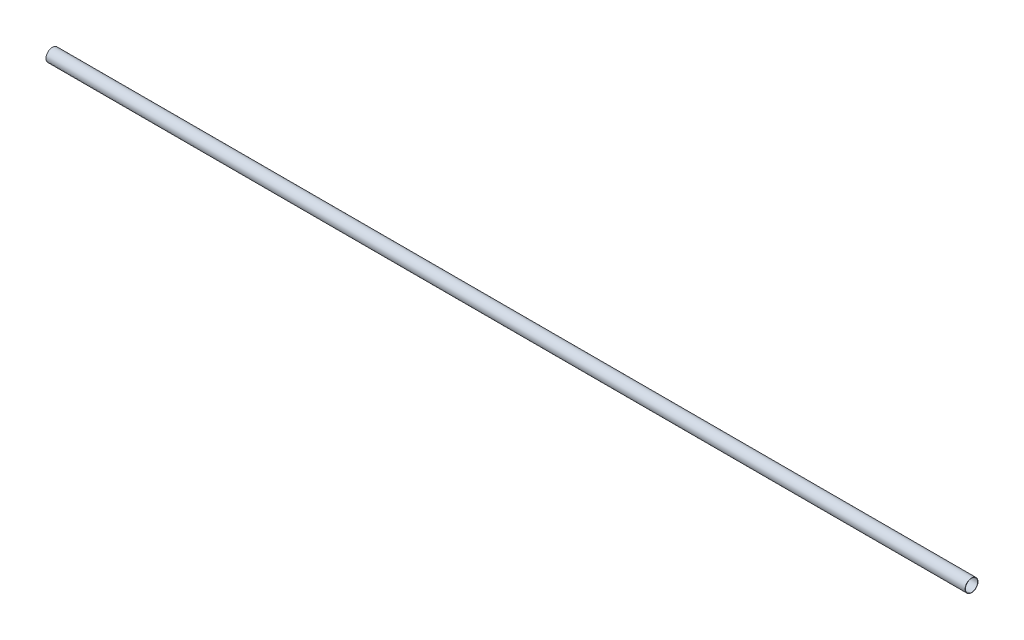
ISO-10303-21;
HEADER;
FILE_DESCRIPTION(('STEP AP214'),'2;1');
FILE_NAME('part.step','',(''),(''),'','','');
FILE_SCHEMA(('AUTOMOTIVE_DESIGN { 1 0 10303 214 1 1 1 1 }'));
ENDSEC;
DATA;
#1=APPLICATION_CONTEXT('core data for automotive mechanical design processes');
#2=APPLICATION_PROTOCOL_DEFINITION('international standard','automotive_design',2000,#1);
#3=PRODUCT_CONTEXT('',#1,'mechanical');
#4=PRODUCT('Part','Part','',(#3));
#5=PRODUCT_RELATED_PRODUCT_CATEGORY('part','',(#4));
#6=PRODUCT_DEFINITION_FORMATION('','',#4);
#7=PRODUCT_DEFINITION_CONTEXT('part definition',#1,'design');
#8=PRODUCT_DEFINITION('design','',#6,#7);
#9=PRODUCT_DEFINITION_SHAPE('','',#8);
#10=(LENGTH_UNIT() NAMED_UNIT(*) SI_UNIT(.MILLI.,.METRE.));
#11=(NAMED_UNIT(*) PLANE_ANGLE_UNIT() SI_UNIT($,.RADIAN.));
#12=(NAMED_UNIT(*) SI_UNIT($,.STERADIAN.) SOLID_ANGLE_UNIT());
#13=UNCERTAINTY_MEASURE_WITH_UNIT(LENGTH_MEASURE(1.E-05),#10,'distance_accuracy_value','');
#14=(GEOMETRIC_REPRESENTATION_CONTEXT(3) GLOBAL_UNCERTAINTY_ASSIGNED_CONTEXT((#13)) GLOBAL_UNIT_ASSIGNED_CONTEXT((#10,
#11,#12)) REPRESENTATION_CONTEXT('',''));
#15=CARTESIAN_POINT('',(0.,0.,0.));
#16=DIRECTION('',(0.,0.,1.));
#17=DIRECTION('',(1.,0.,0.));
#18=AXIS2_PLACEMENT_3D('',#15,#16,#17);
#19=CARTESIAN_POINT('',(300.,0.,0.));
#20=DIRECTION('',(1.,0.,0.));
#21=DIRECTION('',(0.,0.,-1.));
#22=AXIS2_PLACEMENT_3D('',#19,#20,#21);
#23=PLANE('',#22);
#24=CARTESIAN_POINT('',(300.,0.,0.));
#25=DIRECTION('',(1.,0.,0.));
#26=DIRECTION('',(0.,0.,-1.));
#27=AXIS2_PLACEMENT_3D('',#24,#25,#26);
#28=CIRCLE('',#27,2.1);
#29=CARTESIAN_POINT('',(300.,0.,-2.1));
#30=VERTEX_POINT('',#29);
#31=EDGE_CURVE('E11',#30,#30,#28,.T.);
#32=ORIENTED_EDGE('',*,*,#31,.T.);
#33=EDGE_LOOP('',(#32));
#34=FACE_BOUND('',#33,.T.);
#35=CARTESIAN_POINT('',(300.,0.,0.));
#36=DIRECTION('',(1.,0.,0.));
#37=DIRECTION('',(0.,0.,-1.));
#38=AXIS2_PLACEMENT_3D('',#35,#36,#37);
#39=CIRCLE('',#38,2.);
#40=CARTESIAN_POINT('',(300.,0.,-2.));
#41=VERTEX_POINT('',#40);
#42=EDGE_CURVE('E56',#41,#41,#39,.T.);
#43=ORIENTED_EDGE('',*,*,#42,.F.);
#44=EDGE_LOOP('',(#43));
#45=FACE_BOUND('',#44,.T.);
#46=ADVANCED_FACE('F43',(#34,#45),#23,.T.);
#47=CARTESIAN_POINT('',(0.,0.,0.));
#48=DIRECTION('',(1.,0.,0.));
#49=DIRECTION('',(0.,0.,-1.));
#50=AXIS2_PLACEMENT_3D('',#47,#48,#49);
#51=PLANE('',#50);
#52=CARTESIAN_POINT('',(0.,0.,0.));
#53=DIRECTION('',(1.,0.,0.));
#54=DIRECTION('',(0.,0.,-1.));
#55=AXIS2_PLACEMENT_3D('',#52,#53,#54);
#56=CIRCLE('',#55,2.1);
#57=CARTESIAN_POINT('',(0.,0.,-2.1));
#58=VERTEX_POINT('',#57);
#59=EDGE_CURVE('E47',#58,#58,#56,.T.);
#60=ORIENTED_EDGE('',*,*,#59,.F.);
#61=EDGE_LOOP('',(#60));
#62=FACE_BOUND('',#61,.T.);
#63=CARTESIAN_POINT('',(0.,0.,0.));
#64=DIRECTION('',(1.,0.,0.));
#65=DIRECTION('',(0.,0.,-1.));
#66=AXIS2_PLACEMENT_3D('',#63,#64,#65);
#67=CIRCLE('',#66,2.);
#68=CARTESIAN_POINT('',(0.,0.,-2.));
#69=VERTEX_POINT('',#68);
#70=EDGE_CURVE('E58',#69,#69,#67,.T.);
#71=ORIENTED_EDGE('',*,*,#70,.T.);
#72=EDGE_LOOP('',(#71));
#73=FACE_BOUND('',#72,.T.);
#74=ADVANCED_FACE('F70',(#62,#73),#51,.F.);
#75=CARTESIAN_POINT('',(300.,0.,0.));
#76=DIRECTION('',(-1.,0.,0.));
#77=DIRECTION('',(0.,0.,1.));
#78=AXIS2_PLACEMENT_3D('',#75,#76,#77);
#79=CYLINDRICAL_SURFACE('',#78,2.1);
#80=ORIENTED_EDGE('',*,*,#31,.F.);
#81=EDGE_LOOP('',(#80));
#82=FACE_BOUND('',#81,.T.);
#83=ORIENTED_EDGE('',*,*,#59,.T.);
#84=EDGE_LOOP('',(#83));
#85=FACE_BOUND('',#84,.T.);
#86=ADVANCED_FACE('F45',(#82,#85),#79,.T.);
#87=CARTESIAN_POINT('',(300.,0.,0.));
#88=DIRECTION('',(-1.,0.,0.));
#89=DIRECTION('',(0.,0.,1.));
#90=AXIS2_PLACEMENT_3D('',#87,#88,#89);
#91=CYLINDRICAL_SURFACE('',#90,2.);
#92=ORIENTED_EDGE('',*,*,#42,.T.);
#93=EDGE_LOOP('',(#92));
#94=FACE_BOUND('',#93,.T.);
#95=ORIENTED_EDGE('',*,*,#70,.F.);
#96=EDGE_LOOP('',(#95));
#97=FACE_BOUND('',#96,.T.);
#98=ADVANCED_FACE('F66',(#94,#97),#91,.F.);
#99=CLOSED_SHELL('',(#46,#74,#86,#98));
#100=MANIFOLD_SOLID_BREP('B2',#99);
#101=ADVANCED_BREP_SHAPE_REPRESENTATION('',(#18,#100),#14);
#102=SHAPE_DEFINITION_REPRESENTATION(#9,#101);
ENDSEC;
END-ISO-10303-21;
